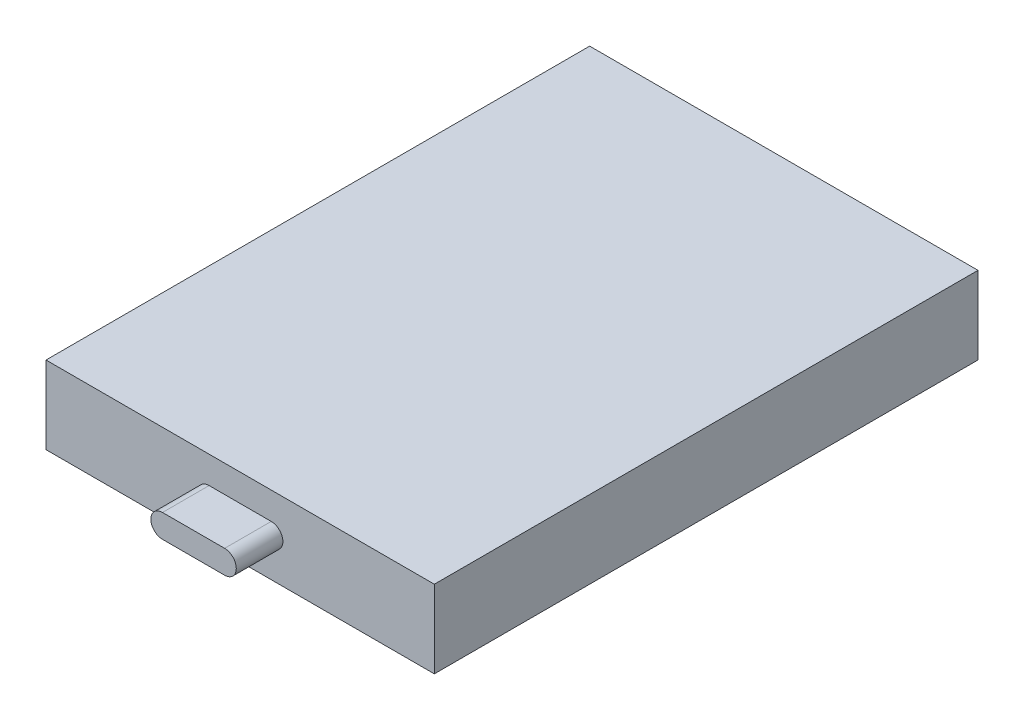
ISO-10303-21;
HEADER;
FILE_DESCRIPTION(('STEP AP214'),'2;1');
FILE_NAME('part.step','',(''),(''),'','','');
FILE_SCHEMA(('AUTOMOTIVE_DESIGN { 1 0 10303 214 1 1 1 1 }'));
ENDSEC;
DATA;
#1=APPLICATION_CONTEXT('core data for automotive mechanical design processes');
#2=APPLICATION_PROTOCOL_DEFINITION('international standard','automotive_design',2000,#1);
#3=PRODUCT_CONTEXT('',#1,'mechanical');
#4=PRODUCT('Part','Part','',(#3));
#5=PRODUCT_RELATED_PRODUCT_CATEGORY('part','',(#4));
#6=PRODUCT_DEFINITION_FORMATION('','',#4);
#7=PRODUCT_DEFINITION_CONTEXT('part definition',#1,'design');
#8=PRODUCT_DEFINITION('design','',#6,#7);
#9=PRODUCT_DEFINITION_SHAPE('','',#8);
#10=(LENGTH_UNIT() NAMED_UNIT(*) SI_UNIT(.MILLI.,.METRE.));
#11=(NAMED_UNIT(*) PLANE_ANGLE_UNIT() SI_UNIT($,.RADIAN.));
#12=(NAMED_UNIT(*) SI_UNIT($,.STERADIAN.) SOLID_ANGLE_UNIT());
#13=UNCERTAINTY_MEASURE_WITH_UNIT(LENGTH_MEASURE(1.E-05),#10,'distance_accuracy_value','');
#14=(GEOMETRIC_REPRESENTATION_CONTEXT(3) GLOBAL_UNCERTAINTY_ASSIGNED_CONTEXT((#13)) GLOBAL_UNIT_ASSIGNED_CONTEXT((#10,
#11,#12)) REPRESENTATION_CONTEXT('',''));
#15=CARTESIAN_POINT('',(0.,0.,0.));
#16=DIRECTION('',(0.,0.,1.));
#17=DIRECTION('',(1.,0.,0.));
#18=AXIS2_PLACEMENT_3D('',#15,#16,#17);
#19=CARTESIAN_POINT('',(0.,0.,35.));
#20=DIRECTION('',(1.,0.,0.));
#21=DIRECTION('',(0.,0.,-1.));
#22=AXIS2_PLACEMENT_3D('',#19,#20,#21);
#23=PLANE('',#22);
#24=DIRECTION('',(0.,-1.,0.));
#25=VECTOR('',#24,1.);
#26=CARTESIAN_POINT('',(0.,0.,0.));
#27=LINE('',#26,#25);
#28=CARTESIAN_POINT('',(0.,0.,0.));
#29=VERTEX_POINT('',#28);
#30=CARTESIAN_POINT('',(0.,-5.,0.));
#31=VERTEX_POINT('',#30);
#32=EDGE_CURVE('E123',#29,#31,#27,.T.);
#33=ORIENTED_EDGE('',*,*,#32,.T.);
#34=DIRECTION('',(0.,0.,-1.));
#35=VECTOR('',#34,1.);
#36=CARTESIAN_POINT('',(0.,-5.,35.));
#37=LINE('',#36,#35);
#38=CARTESIAN_POINT('',(0.,-5.,35.));
#39=VERTEX_POINT('',#38);
#40=EDGE_CURVE('E11',#39,#31,#37,.T.);
#41=ORIENTED_EDGE('',*,*,#40,.F.);
#42=DIRECTION('',(0.,-1.,0.));
#43=VECTOR('',#42,1.);
#44=CARTESIAN_POINT('',(0.,0.,35.));
#45=LINE('',#44,#43);
#46=CARTESIAN_POINT('',(0.,0.,35.));
#47=VERTEX_POINT('',#46);
#48=EDGE_CURVE('E132',#47,#39,#45,.T.);
#49=ORIENTED_EDGE('',*,*,#48,.F.);
#50=DIRECTION('',(0.,0.,-1.));
#51=VECTOR('',#50,1.);
#52=CARTESIAN_POINT('',(0.,0.,35.));
#53=LINE('',#52,#51);
#54=EDGE_CURVE('E141',#47,#29,#53,.T.);
#55=ORIENTED_EDGE('',*,*,#54,.T.);
#56=EDGE_LOOP('',(#33,#41,#49,#55));
#57=FACE_BOUND('',#56,.T.);
#58=ADVANCED_FACE('F39',(#57),#23,.F.);
#59=CARTESIAN_POINT('',(0.,-5.,35.));
#60=DIRECTION('',(0.,1.,0.));
#61=DIRECTION('',(0.,0.,1.));
#62=AXIS2_PLACEMENT_3D('',#59,#60,#61);
#63=PLANE('',#62);
#64=DIRECTION('',(1.,0.,0.));
#65=VECTOR('',#64,1.);
#66=CARTESIAN_POINT('',(0.,-5.,0.));
#67=LINE('',#66,#65);
#68=CARTESIAN_POINT('',(25.,-5.,0.));
#69=VERTEX_POINT('',#68);
#70=EDGE_CURVE('E126',#31,#69,#67,.T.);
#71=ORIENTED_EDGE('',*,*,#70,.T.);
#72=DIRECTION('',(0.,0.,-1.));
#73=VECTOR('',#72,1.);
#74=CARTESIAN_POINT('',(25.,-5.,35.));
#75=LINE('',#74,#73);
#76=CARTESIAN_POINT('',(25.,-5.,35.));
#77=VERTEX_POINT('',#76);
#78=EDGE_CURVE('E46',#77,#69,#75,.T.);
#79=ORIENTED_EDGE('',*,*,#78,.F.);
#80=DIRECTION('',(1.,0.,0.));
#81=VECTOR('',#80,1.);
#82=CARTESIAN_POINT('',(0.,-5.,35.));
#83=LINE('',#82,#81);
#84=EDGE_CURVE('E135',#39,#77,#83,.T.);
#85=ORIENTED_EDGE('',*,*,#84,.F.);
#86=ORIENTED_EDGE('',*,*,#40,.T.);
#87=EDGE_LOOP('',(#71,#79,#85,#86));
#88=FACE_BOUND('',#87,.T.);
#89=ADVANCED_FACE('F172',(#88),#63,.F.);
#90=CARTESIAN_POINT('',(25.,0.,35.));
#91=DIRECTION('',(-1.,0.,0.));
#92=DIRECTION('',(0.,0.,1.));
#93=AXIS2_PLACEMENT_3D('',#90,#91,#92);
#94=PLANE('',#93);
#95=DIRECTION('',(0.,1.,0.));
#96=VECTOR('',#95,1.);
#97=CARTESIAN_POINT('',(25.,0.,0.));
#98=LINE('',#97,#96);
#99=CARTESIAN_POINT('',(25.,0.,0.));
#100=VERTEX_POINT('',#99);
#101=EDGE_CURVE('E144',#69,#100,#98,.T.);
#102=ORIENTED_EDGE('',*,*,#101,.T.);
#103=DIRECTION('',(0.,0.,-1.));
#104=VECTOR('',#103,1.);
#105=CARTESIAN_POINT('',(25.,0.,35.));
#106=LINE('',#105,#104);
#107=CARTESIAN_POINT('',(25.,0.,35.));
#108=VERTEX_POINT('',#107);
#109=EDGE_CURVE('E149',#108,#100,#106,.T.);
#110=ORIENTED_EDGE('',*,*,#109,.F.);
#111=DIRECTION('',(0.,1.,0.));
#112=VECTOR('',#111,1.);
#113=CARTESIAN_POINT('',(25.,0.,35.));
#114=LINE('',#113,#112);
#115=EDGE_CURVE('E138',#77,#108,#114,.T.);
#116=ORIENTED_EDGE('',*,*,#115,.F.);
#117=ORIENTED_EDGE('',*,*,#78,.T.);
#118=EDGE_LOOP('',(#102,#110,#116,#117));
#119=FACE_BOUND('',#118,.T.);
#120=ADVANCED_FACE('F156',(#119),#94,.F.);
#121=CARTESIAN_POINT('',(0.,0.,35.));
#122=DIRECTION('',(0.,-1.,0.));
#123=DIRECTION('',(0.,0.,-1.));
#124=AXIS2_PLACEMENT_3D('',#121,#122,#123);
#125=PLANE('',#124);
#126=DIRECTION('',(-1.,0.,0.));
#127=VECTOR('',#126,1.);
#128=CARTESIAN_POINT('',(0.,0.,0.));
#129=LINE('',#128,#127);
#130=EDGE_CURVE('E136',#100,#29,#129,.T.);
#131=ORIENTED_EDGE('',*,*,#130,.T.);
#132=ORIENTED_EDGE('',*,*,#54,.F.);
#133=DIRECTION('',(-1.,0.,0.));
#134=VECTOR('',#133,1.);
#135=CARTESIAN_POINT('',(0.,0.,35.));
#136=LINE('',#135,#134);
#137=EDGE_CURVE('E140',#108,#47,#136,.T.);
#138=ORIENTED_EDGE('',*,*,#137,.F.);
#139=ORIENTED_EDGE('',*,*,#109,.T.);
#140=EDGE_LOOP('',(#131,#132,#138,#139));
#141=FACE_BOUND('',#140,.T.);
#142=ADVANCED_FACE('F165',(#141),#125,.F.);
#143=CARTESIAN_POINT('',(0.,0.,35.));
#144=DIRECTION('',(0.,0.,1.));
#145=DIRECTION('',(1.,0.,0.));
#146=AXIS2_PLACEMENT_3D('',#143,#144,#145);
#147=PLANE('',#146);
#148=CARTESIAN_POINT('',(10.5,-2.5,35.));
#149=DIRECTION('',(0.,0.,1.));
#150=DIRECTION('',(1.,0.,0.));
#151=AXIS2_PLACEMENT_3D('',#148,#149,#150);
#152=CIRCLE('',#151,0.75);
#153=CARTESIAN_POINT('',(10.5,-1.75,35.));
#154=VERTEX_POINT('',#153);
#155=CARTESIAN_POINT('',(10.5,-3.25,35.));
#156=VERTEX_POINT('',#155);
#157=EDGE_CURVE('E53',#154,#156,#152,.T.);
#158=ORIENTED_EDGE('',*,*,#157,.F.);
#159=DIRECTION('',(-1.,0.,0.));
#160=VECTOR('',#159,1.);
#161=CARTESIAN_POINT('',(10.5,-1.75,35.));
#162=LINE('',#161,#160);
#163=CARTESIAN_POINT('',(14.5,-1.75,35.));
#164=VERTEX_POINT('',#163);
#165=EDGE_CURVE('E57',#164,#154,#162,.T.);
#166=ORIENTED_EDGE('',*,*,#165,.F.);
#167=CARTESIAN_POINT('',(14.5,-2.5,35.));
#168=DIRECTION('',(0.,0.,1.));
#169=DIRECTION('',(1.,0.,0.));
#170=AXIS2_PLACEMENT_3D('',#167,#168,#169);
#171=CIRCLE('',#170,0.75);
#172=CARTESIAN_POINT('',(14.5,-3.25,35.));
#173=VERTEX_POINT('',#172);
#174=EDGE_CURVE('E266',#173,#164,#171,.T.);
#175=ORIENTED_EDGE('',*,*,#174,.F.);
#176=DIRECTION('',(1.,0.,0.));
#177=VECTOR('',#176,1.);
#178=CARTESIAN_POINT('',(10.5,-3.25,35.));
#179=LINE('',#178,#177);
#180=EDGE_CURVE('E272',#156,#173,#179,.T.);
#181=ORIENTED_EDGE('',*,*,#180,.F.);
#182=EDGE_LOOP('',(#158,#166,#175,#181));
#183=FACE_BOUND('',#182,.T.);
#184=ORIENTED_EDGE('',*,*,#48,.T.);
#185=ORIENTED_EDGE('',*,*,#84,.T.);
#186=ORIENTED_EDGE('',*,*,#115,.T.);
#187=ORIENTED_EDGE('',*,*,#137,.T.);
#188=EDGE_LOOP('',(#184,#185,#186,#187));
#189=FACE_BOUND('',#188,.T.);
#190=ADVANCED_FACE('F171',(#183,#189),#147,.T.);
#191=CARTESIAN_POINT('',(0.,0.,0.));
#192=DIRECTION('',(0.,0.,1.));
#193=DIRECTION('',(1.,0.,0.));
#194=AXIS2_PLACEMENT_3D('',#191,#192,#193);
#195=PLANE('',#194);
#196=ORIENTED_EDGE('',*,*,#32,.F.);
#197=ORIENTED_EDGE('',*,*,#130,.F.);
#198=ORIENTED_EDGE('',*,*,#101,.F.);
#199=ORIENTED_EDGE('',*,*,#70,.F.);
#200=EDGE_LOOP('',(#196,#197,#198,#199));
#201=FACE_BOUND('',#200,.T.);
#202=ADVANCED_FACE('F162',(#201),#195,.F.);
#203=CARTESIAN_POINT('',(10.5,-2.5,38.));
#204=DIRECTION('',(0.,0.,-1.));
#205=DIRECTION('',(-1.,0.,0.));
#206=AXIS2_PLACEMENT_3D('',#203,#204,#205);
#207=CYLINDRICAL_SURFACE('',#206,0.75);
#208=ORIENTED_EDGE('',*,*,#157,.T.);
#209=DIRECTION('',(0.,0.,-1.));
#210=VECTOR('',#209,1.);
#211=CARTESIAN_POINT('',(10.5,-3.25,38.));
#212=LINE('',#211,#210);
#213=CARTESIAN_POINT('',(10.5,-3.25,38.));
#214=VERTEX_POINT('',#213);
#215=EDGE_CURVE('E106',#214,#156,#212,.T.);
#216=ORIENTED_EDGE('',*,*,#215,.F.);
#217=CARTESIAN_POINT('',(10.5,-2.5,38.));
#218=DIRECTION('',(0.,0.,1.));
#219=DIRECTION('',(1.,0.,0.));
#220=AXIS2_PLACEMENT_3D('',#217,#218,#219);
#221=CIRCLE('',#220,0.75);
#222=CARTESIAN_POINT('',(10.5,-1.75,38.));
#223=VERTEX_POINT('',#222);
#224=EDGE_CURVE('E112',#223,#214,#221,.T.);
#225=ORIENTED_EDGE('',*,*,#224,.F.);
#226=DIRECTION('',(0.,0.,-1.));
#227=VECTOR('',#226,1.);
#228=CARTESIAN_POINT('',(10.5,-1.75,38.));
#229=LINE('',#228,#227);
#230=EDGE_CURVE('E264',#223,#154,#229,.T.);
#231=ORIENTED_EDGE('',*,*,#230,.T.);
#232=EDGE_LOOP('',(#208,#216,#225,#231));
#233=FACE_BOUND('',#232,.T.);
#234=ADVANCED_FACE('F122',(#233),#207,.T.);
#235=CARTESIAN_POINT('',(10.5,-3.25,38.));
#236=DIRECTION('',(0.,1.,0.));
#237=DIRECTION('',(-1.,0.,0.));
#238=AXIS2_PLACEMENT_3D('',#235,#236,#237);
#239=PLANE('',#238);
#240=ORIENTED_EDGE('',*,*,#180,.T.);
#241=DIRECTION('',(0.,0.,-1.));
#242=VECTOR('',#241,1.);
#243=CARTESIAN_POINT('',(14.5,-3.25,38.));
#244=LINE('',#243,#242);
#245=CARTESIAN_POINT('',(14.5,-3.25,38.));
#246=VERTEX_POINT('',#245);
#247=EDGE_CURVE('E108',#246,#173,#244,.T.);
#248=ORIENTED_EDGE('',*,*,#247,.F.);
#249=DIRECTION('',(1.,0.,0.));
#250=VECTOR('',#249,1.);
#251=CARTESIAN_POINT('',(10.5,-3.25,38.));
#252=LINE('',#251,#250);
#253=EDGE_CURVE('E101',#214,#246,#252,.T.);
#254=ORIENTED_EDGE('',*,*,#253,.F.);
#255=ORIENTED_EDGE('',*,*,#215,.T.);
#256=EDGE_LOOP('',(#240,#248,#254,#255));
#257=FACE_BOUND('',#256,.T.);
#258=ADVANCED_FACE('F104',(#257),#239,.F.);
#259=CARTESIAN_POINT('',(14.5,-2.5,38.));
#260=DIRECTION('',(0.,0.,-1.));
#261=DIRECTION('',(-1.,0.,0.));
#262=AXIS2_PLACEMENT_3D('',#259,#260,#261);
#263=CYLINDRICAL_SURFACE('',#262,0.75);
#264=ORIENTED_EDGE('',*,*,#174,.T.);
#265=DIRECTION('',(0.,0.,-1.));
#266=VECTOR('',#265,1.);
#267=CARTESIAN_POINT('',(14.5,-1.75,38.));
#268=LINE('',#267,#266);
#269=CARTESIAN_POINT('',(14.5,-1.75,38.));
#270=VERTEX_POINT('',#269);
#271=EDGE_CURVE('E128',#270,#164,#268,.T.);
#272=ORIENTED_EDGE('',*,*,#271,.F.);
#273=CARTESIAN_POINT('',(14.5,-2.5,38.));
#274=DIRECTION('',(0.,0.,1.));
#275=DIRECTION('',(1.,0.,0.));
#276=AXIS2_PLACEMENT_3D('',#273,#274,#275);
#277=CIRCLE('',#276,0.75);
#278=EDGE_CURVE('E111',#246,#270,#277,.T.);
#279=ORIENTED_EDGE('',*,*,#278,.F.);
#280=ORIENTED_EDGE('',*,*,#247,.T.);
#281=EDGE_LOOP('',(#264,#272,#279,#280));
#282=FACE_BOUND('',#281,.T.);
#283=ADVANCED_FACE('F190',(#282),#263,.T.);
#284=CARTESIAN_POINT('',(10.5,-1.75,38.));
#285=DIRECTION('',(0.,-1.,0.));
#286=DIRECTION('',(1.,0.,0.));
#287=AXIS2_PLACEMENT_3D('',#284,#285,#286);
#288=PLANE('',#287);
#289=ORIENTED_EDGE('',*,*,#165,.T.);
#290=ORIENTED_EDGE('',*,*,#230,.F.);
#291=DIRECTION('',(-1.,0.,0.));
#292=VECTOR('',#291,1.);
#293=CARTESIAN_POINT('',(10.5,-1.75,38.));
#294=LINE('',#293,#292);
#295=EDGE_CURVE('E117',#270,#223,#294,.T.);
#296=ORIENTED_EDGE('',*,*,#295,.F.);
#297=ORIENTED_EDGE('',*,*,#271,.T.);
#298=EDGE_LOOP('',(#289,#290,#296,#297));
#299=FACE_BOUND('',#298,.T.);
#300=ADVANCED_FACE('F193',(#299),#288,.F.);
#301=CARTESIAN_POINT('',(10.5,-2.5,38.));
#302=DIRECTION('',(0.,0.,1.));
#303=DIRECTION('',(1.,0.,0.));
#304=AXIS2_PLACEMENT_3D('',#301,#302,#303);
#305=PLANE('',#304);
#306=ORIENTED_EDGE('',*,*,#224,.T.);
#307=ORIENTED_EDGE('',*,*,#253,.T.);
#308=ORIENTED_EDGE('',*,*,#278,.T.);
#309=ORIENTED_EDGE('',*,*,#295,.T.);
#310=EDGE_LOOP('',(#306,#307,#308,#309));
#311=FACE_BOUND('',#310,.T.);
#312=ADVANCED_FACE('F115',(#311),#305,.T.);
#313=CLOSED_SHELL('',(#58,#89,#120,#142,#190,#202,#234,#258,#283,#300,#312));
#314=MANIFOLD_SOLID_BREP('B2',#313);
#315=ADVANCED_BREP_SHAPE_REPRESENTATION('',(#18,#314),#14);
#316=SHAPE_DEFINITION_REPRESENTATION(#9,#315);
ENDSEC;
END-ISO-10303-21;
